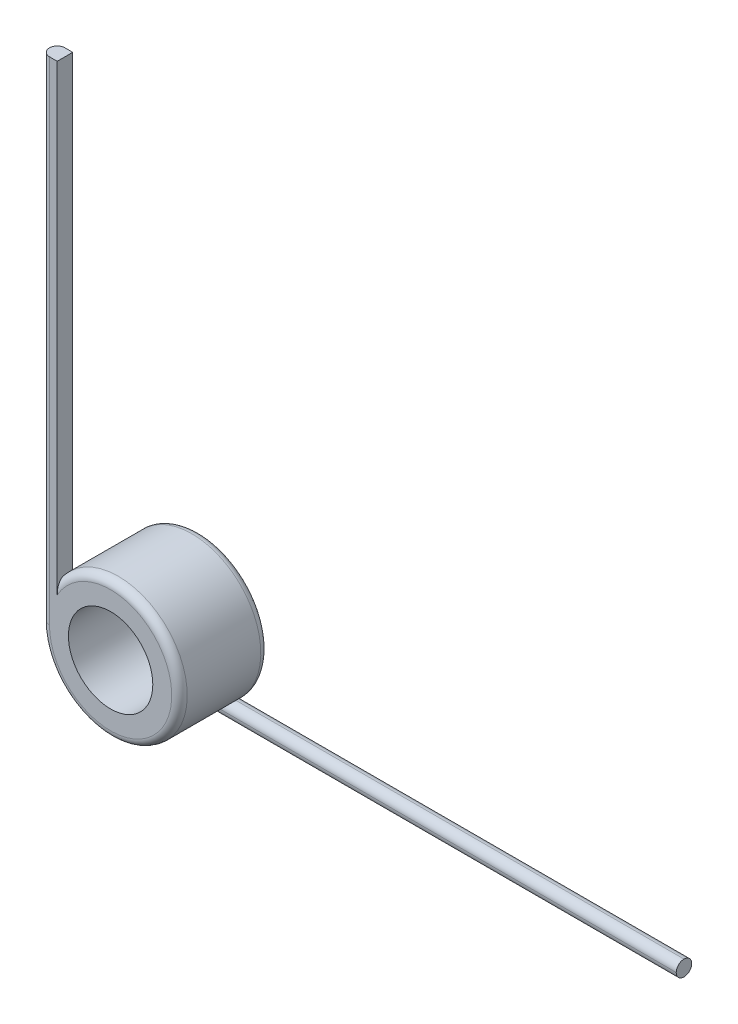
ISO-10303-21;
HEADER;
FILE_DESCRIPTION(('STEP AP214'),'2;1');
FILE_NAME('part.step','',(''),(''),'','','');
FILE_SCHEMA(('AUTOMOTIVE_DESIGN { 1 0 10303 214 1 1 1 1 }'));
ENDSEC;
DATA;
#1=APPLICATION_CONTEXT('core data for automotive mechanical design processes');
#2=APPLICATION_PROTOCOL_DEFINITION('international standard','automotive_design',2000,#1);
#3=PRODUCT_CONTEXT('',#1,'mechanical');
#4=PRODUCT('Part','Part','',(#3));
#5=PRODUCT_RELATED_PRODUCT_CATEGORY('part','',(#4));
#6=PRODUCT_DEFINITION_FORMATION('','',#4);
#7=PRODUCT_DEFINITION_CONTEXT('part definition',#1,'design');
#8=PRODUCT_DEFINITION('design','',#6,#7);
#9=PRODUCT_DEFINITION_SHAPE('','',#8);
#10=(LENGTH_UNIT() NAMED_UNIT(*) SI_UNIT(.MILLI.,.METRE.));
#11=(NAMED_UNIT(*) PLANE_ANGLE_UNIT() SI_UNIT($,.RADIAN.));
#12=(NAMED_UNIT(*) SI_UNIT($,.STERADIAN.) SOLID_ANGLE_UNIT());
#13=UNCERTAINTY_MEASURE_WITH_UNIT(LENGTH_MEASURE(1.E-05),#10,'distance_accuracy_value','');
#14=(GEOMETRIC_REPRESENTATION_CONTEXT(3) GLOBAL_UNCERTAINTY_ASSIGNED_CONTEXT((#13)) GLOBAL_UNIT_ASSIGNED_CONTEXT((#10,
#11,#12)) REPRESENTATION_CONTEXT('',''));
#15=CARTESIAN_POINT('',(0.,0.,0.));
#16=DIRECTION('',(0.,0.,1.));
#17=DIRECTION('',(1.,0.,0.));
#18=AXIS2_PLACEMENT_3D('',#15,#16,#17);
#19=CARTESIAN_POINT('',(0.,0.,9.1948));
#20=DIRECTION('',(0.,0.,-1.));
#21=DIRECTION('',(-1.,0.,0.));
#22=AXIS2_PLACEMENT_3D('',#19,#20,#21);
#23=CYLINDRICAL_SURFACE('',#22,7.112);
#24=DIRECTION('',(0.,0.,1.));
#25=VECTOR('',#24,1.);
#26=CARTESIAN_POINT('',(-5.51179999999997,4.49450828901231,7.5946));
#27=LINE('',#26,#25);
#28=CARTESIAN_POINT('',(-5.51179999999997,4.49450828901231,7.5946));
#29=VERTEX_POINT('',#28);
#30=CARTESIAN_POINT('',(-5.51179999999997,4.49450828901231,8.3947));
#31=VERTEX_POINT('',#30);
#32=EDGE_CURVE('E113',#29,#31,#27,.T.);
#33=ORIENTED_EDGE('',*,*,#32,.T.);
#34=CARTESIAN_POINT('',(0.,0.,8.3947));
#35=DIRECTION('',(0.,0.,1.));
#36=DIRECTION('',(1.,0.,0.));
#37=AXIS2_PLACEMENT_3D('',#34,#35,#36);
#38=CIRCLE('',#37,7.112);
#39=CARTESIAN_POINT('',(-7.112,0.,8.3947));
#40=VERTEX_POINT('',#39);
#41=EDGE_CURVE('E155',#31,#40,#38,.F.);
#42=ORIENTED_EDGE('',*,*,#41,.T.);
#43=CARTESIAN_POINT('',(-6.31189999999998,3.27726446750949,7.5946));
#44=CARTESIAN_POINT('',(-6.33863640810556,3.22577319071098,7.59460874121384));
#45=CARTESIAN_POINT('',(-6.36473209160568,3.17397080121041,7.59593894352443));
#46=CARTESIAN_POINT('',(-6.41559687844701,3.06985554330412,7.60093516358518));
#47=CARTESIAN_POINT('',(-6.44036654805307,3.01754290426369,7.60460017550517));
#48=CARTESIAN_POINT('',(-6.5125478029737,2.86016865994781,7.61861872182236));
#49=CARTESIAN_POINT('',(-6.55794815943721,2.75444607475935,7.6319984877271));
#50=CARTESIAN_POINT('',(-6.64307265846747,2.54227229890445,7.66493502375928));
#51=CARTESIAN_POINT('',(-6.68282029059782,2.43582617169207,7.6844650790488));
#52=CARTESIAN_POINT('',(-6.75692707930679,2.22200236123472,7.72839217607958));
#53=CARTESIAN_POINT('',(-6.79128248733931,2.11462408422718,7.75279257703432));
#54=CARTESIAN_POINT('',(-6.87124565452522,1.84276867346078,7.81917071884919));
#55=CARTESIAN_POINT('',(-6.91331709761538,1.67785384252942,7.86365942235867));
#56=CARTESIAN_POINT('',(-6.98530174523663,1.34713711270924,7.95853999945249));
#57=CARTESIAN_POINT('',(-7.01521160149209,1.18133498224522,8.00893349380584));
#58=CARTESIAN_POINT('',(-7.08709086236258,0.682899888290358,8.16566943485298));
#59=CARTESIAN_POINT('',(-7.11123322508794,0.349157968962982,8.27758917674899));
#60=CARTESIAN_POINT('',(-7.11199400277877,0.0106605278621833,8.39112437230443));
#61=CARTESIAN_POINT('',(-7.1119999947834,0.00533018613457503,8.39291222380705));
#62=CARTESIAN_POINT('',(-7.112,0.,8.3947));
#63=B_SPLINE_CURVE_WITH_KNOTS('',3,(#43,#44,#45,#46,#47,#48,#49,#50,#51,#52,#53,#54,#55,#56,#57,
#58,#59,#60,#61,#62),.UNSPECIFIED.,.F.,.F.,(4,2,2,2,2,2,2,2,2,4),(0.,0.174006957486823,
0.347939003854618,0.695046557647384,1.04066671662638,1.38652608839392,1.91360707300454,
2.44083307318049,3.49502816093425,3.51189470542901),.UNSPECIFIED.);
#64=CARTESIAN_POINT('',(-6.31189999999998,3.27726446750949,7.5946));
#65=VERTEX_POINT('',#64);
#66=EDGE_CURVE('E116',#40,#65,#63,.F.);
#67=ORIENTED_EDGE('',*,*,#66,.T.);
#68=CARTESIAN_POINT('',(0.,0.,7.5946));
#69=DIRECTION('',(0.,0.,-1.));
#70=DIRECTION('',(1.,0.,0.));
#71=AXIS2_PLACEMENT_3D('',#68,#69,#70);
#72=CIRCLE('',#71,7.112);
#73=EDGE_CURVE('E111',#65,#29,#72,.T.);
#74=ORIENTED_EDGE('',*,*,#73,.T.);
#75=EDGE_LOOP('',(#33,#42,#67,#74));
#76=FACE_BOUND('',#75,.T.);
#77=CARTESIAN_POINT('',(3.27726446750945,-6.3119,1.6002));
#78=CARTESIAN_POINT('',(3.22577319071094,-6.33863640810558,1.60019125878616));
#79=CARTESIAN_POINT('',(3.17397080121037,-6.3647320916057,1.59886105647557));
#80=CARTESIAN_POINT('',(3.06985554330409,-6.41559687844702,1.59386483641482));
#81=CARTESIAN_POINT('',(3.01754290426367,-6.44036654805308,1.59019982449484));
#82=CARTESIAN_POINT('',(2.8601686599478,-6.51254780297371,1.57618127817764));
#83=CARTESIAN_POINT('',(2.75444607475934,-6.55794815943721,1.56280151227291));
#84=CARTESIAN_POINT('',(2.54227229890444,-6.64307265846747,1.52986497624073));
#85=CARTESIAN_POINT('',(2.43582617169205,-6.68282029059783,1.5103349209512));
#86=CARTESIAN_POINT('',(2.22200236123469,-6.7569270793068,1.46640782392042));
#87=CARTESIAN_POINT('',(2.11462408422714,-6.79128248733932,1.44200742296568));
#88=CARTESIAN_POINT('',(1.84276867346074,-6.87124565452523,1.37562928115081));
#89=CARTESIAN_POINT('',(1.67785384252937,-6.9133170976154,1.33114057764134));
#90=CARTESIAN_POINT('',(1.34713711270919,-6.98530174523664,1.2362600005475));
#91=CARTESIAN_POINT('',(1.18133498224518,-7.0152116014921,1.1858665061941));
#92=CARTESIAN_POINT('',(0.682899888290263,-7.08709086236258,1.02913056514713));
#93=CARTESIAN_POINT('',(0.349157968962726,-7.11123322508794,0.91721082325161));
#94=CARTESIAN_POINT('',(0.010660527862127,-7.11199400277877,0.803675627695595));
#95=CARTESIAN_POINT('',(0.00533018613452203,-7.1119999947834,0.801887776192962));
#96=CARTESIAN_POINT('',(0.,-7.112,0.8001));
#97=B_SPLINE_CURVE_WITH_KNOTS('',3,(#77,#78,#79,#80,#81,#82,#83,#84,#85,#86,#87,#88,#89,#90,#91,
#92,#93,#94,#95,#96),.UNSPECIFIED.,.F.,.F.,(4,2,2,2,2,2,2,2,2,4),(0.,0.174006957486809,
0.347939003854589,0.695046557647333,1.04066671662635,1.38652608839392,1.91360707300454,
2.4408330731805,3.49502816093425,3.51189470542901),.UNSPECIFIED.);
#98=CARTESIAN_POINT('',(0.,-7.112,0.8001));
#99=VERTEX_POINT('',#98);
#100=CARTESIAN_POINT('',(3.27726446750945,-6.3119,1.6002));
#101=VERTEX_POINT('',#100);
#102=EDGE_CURVE('E44',#99,#101,#97,.F.);
#103=ORIENTED_EDGE('',*,*,#102,.T.);
#104=CARTESIAN_POINT('',(3.27726446750944,-6.3119,1.6002));
#105=CARTESIAN_POINT('',(3.33684636501457,-6.28097233450951,1.60017049334555));
#106=CARTESIAN_POINT('',(3.39603078899823,-6.24916342132022,1.59840213107609));
#107=CARTESIAN_POINT('',(3.51355143645542,-6.1838510683771,1.59058391450078));
#108=CARTESIAN_POINT('',(3.57188188450809,-6.15033989895407,1.58451253492));
#109=CARTESIAN_POINT('',(3.68766233258711,-6.08163436560927,1.56717472422965));
#110=CARTESIAN_POINT('',(3.74509577354935,-6.04642562220361,1.55585231329157));
#111=CARTESIAN_POINT('',(3.85771272353521,-5.97519985193681,1.52692175758249));
#112=CARTESIAN_POINT('',(3.91290116558248,-5.93918490073875,1.50932832797823));
#113=CARTESIAN_POINT('',(4.00525249208175,-5.87713169880061,1.4724463789553));
#114=CARTESIAN_POINT('',(4.04315445374767,-5.8511087348269,1.45499498077383));
#115=CARTESIAN_POINT('',(4.11678717653781,-5.79953625179383,1.41548426425632));
#116=CARTESIAN_POINT('',(4.15252050554959,-5.77398619871112,1.39343053861775));
#117=CARTESIAN_POINT('',(4.22138970936993,-5.72383115259485,1.34378451989652));
#118=CARTESIAN_POINT('',(4.25449880463333,-5.69923695516696,1.31614336190655));
#119=CARTESIAN_POINT('',(4.31651957433504,-5.65240697734943,1.25475689981927));
#120=CARTESIAN_POINT('',(4.34543791946912,-5.63016746439981,1.22102149303283));
#121=CARTESIAN_POINT('',(4.38939727605734,-5.59591490763217,1.15840313928524));
#122=CARTESIAN_POINT('',(4.40597974002243,-5.58285251332364,1.13118262316452));
#123=CARTESIAN_POINT('',(4.43551677737668,-5.55941455104074,1.07374889291683));
#124=CARTESIAN_POINT('',(4.44847432845384,-5.54903677831235,1.04353816288834));
#125=CARTESIAN_POINT('',(4.46851837696362,-5.53290439682252,0.984832314482142));
#126=CARTESIAN_POINT('',(4.47615757469814,-5.52671766818688,0.956646183382705));
#127=CARTESIAN_POINT('',(4.48762439734802,-5.51741148642021,0.899053502659542));
#128=CARTESIAN_POINT('',(4.49146083255315,-5.51428494362298,0.869649939178288));
#129=CARTESIAN_POINT('',(4.4941023454781,-5.51213071648264,0.826766808368351));
#130=CARTESIAN_POINT('',(4.49451449298493,-5.51179415880985,0.81343061952327));
#131=CARTESIAN_POINT('',(4.49450828901227,-5.51180000000001,0.8001));
#132=B_SPLINE_CURVE_WITH_KNOTS('',3,(#104,#105,#106,#107,#108,#109,#110,#111,#112,#113,#114,
#115,#116,#117,#118,#119,#120,#121,#122,#123,#124,#125,#126,#127,#128,#129,#130,#131),
.UNSPECIFIED.,.F.,.F.,(4,2,2,2,2,2,2,2,2,2,2,2,2,4),(0.,0.201444525566419,0.403903928729936,
0.608573143021147,0.81276522170529,0.96008176445519,1.10722032145835,1.25570615356907,
1.40395297175356,1.50694498887674,1.60985215301296,1.69902772272233,1.78799620300548,
1.82799412834761),.UNSPECIFIED.);
#133=CARTESIAN_POINT('',(4.49450828901226,-5.51180000000001,0.8001));
#134=VERTEX_POINT('',#133);
#135=EDGE_CURVE('E11',#101,#134,#132,.T.);
#136=ORIENTED_EDGE('',*,*,#135,.T.);
#137=CARTESIAN_POINT('',(0.,0.,0.8001));
#138=DIRECTION('',(0.,0.,1.));
#139=DIRECTION('',(1.,0.,0.));
#140=AXIS2_PLACEMENT_3D('',#137,#138,#139);
#141=CIRCLE('',#140,7.112);
#142=EDGE_CURVE('E260',#134,#99,#141,.T.);
#143=ORIENTED_EDGE('',*,*,#142,.T.);
#144=EDGE_LOOP('',(#103,#136,#143));
#145=FACE_BOUND('',#144,.T.);
#146=ADVANCED_FACE('F34',(#76,#145),#23,.T.);
#147=CARTESIAN_POINT('',(0.,0.,9.1948));
#148=DIRECTION('',(0.,0.,1.));
#149=DIRECTION('',(1.,0.,0.));
#150=AXIS2_PLACEMENT_3D('',#147,#148,#149);
#151=PLANE('',#150);
#152=CARTESIAN_POINT('',(0.,0.,9.1948));
#153=DIRECTION('',(0.,0.,1.));
#154=DIRECTION('',(1.,0.,0.));
#155=AXIS2_PLACEMENT_3D('',#152,#153,#154);
#156=CIRCLE('',#155,6.3119);
#157=CARTESIAN_POINT('',(-6.3119,0.,9.1948));
#158=VERTEX_POINT('',#157);
#159=CARTESIAN_POINT('',(-5.51179999999998,3.07573444399875,9.1948));
#160=VERTEX_POINT('',#159);
#161=EDGE_CURVE('E152',#158,#160,#156,.T.);
#162=ORIENTED_EDGE('',*,*,#161,.T.);
#163=DIRECTION('',(0.,1.,0.));
#164=VECTOR('',#163,1.);
#165=CARTESIAN_POINT('',(-5.51179999999965,50.8,9.1948));
#166=LINE('',#165,#164);
#167=CARTESIAN_POINT('',(-5.51179999999965,50.8,9.1948));
#168=VERTEX_POINT('',#167);
#169=EDGE_CURVE('E137',#160,#168,#166,.T.);
#170=ORIENTED_EDGE('',*,*,#169,.T.);
#171=DIRECTION('',(-1.,0.,0.));
#172=VECTOR('',#171,1.);
#173=CARTESIAN_POINT('',(-7.11199999999965,50.8,9.1948));
#174=LINE('',#173,#172);
#175=CARTESIAN_POINT('',(-6.31189999999965,50.8,9.1948));
#176=VERTEX_POINT('',#175);
#177=EDGE_CURVE('E121',#168,#176,#174,.T.);
#178=ORIENTED_EDGE('',*,*,#177,.T.);
#179=DIRECTION('',(0.,-1.,0.));
#180=VECTOR('',#179,1.);
#181=CARTESIAN_POINT('',(-6.3119,0.,9.1948));
#182=LINE('',#181,#180);
#183=EDGE_CURVE('E148',#176,#158,#182,.T.);
#184=ORIENTED_EDGE('',*,*,#183,.T.);
#185=EDGE_LOOP('',(#162,#170,#178,#184));
#186=FACE_BOUND('',#185,.T.);
#187=CARTESIAN_POINT('',(0.,0.,9.1948));
#188=DIRECTION('',(0.,0.,1.));
#189=DIRECTION('',(1.,0.,0.));
#190=AXIS2_PLACEMENT_3D('',#187,#188,#189);
#191=CIRCLE('',#190,4.3561);
#192=CARTESIAN_POINT('',(4.3561,0.,9.1948));
#193=VERTEX_POINT('',#192);
#194=EDGE_CURVE('E145',#193,#193,#191,.T.);
#195=ORIENTED_EDGE('',*,*,#194,.F.);
#196=EDGE_LOOP('',(#195));
#197=FACE_BOUND('',#196,.T.);
#198=ADVANCED_FACE('F191',(#186,#197),#151,.T.);
#199=CARTESIAN_POINT('',(0.,0.,0.));
#200=DIRECTION('',(0.,0.,1.));
#201=DIRECTION('',(1.,0.,0.));
#202=AXIS2_PLACEMENT_3D('',#199,#200,#201);
#203=PLANE('',#202);
#204=CARTESIAN_POINT('',(0.,0.,0.));
#205=DIRECTION('',(0.,0.,1.));
#206=DIRECTION('',(1.,0.,0.));
#207=AXIS2_PLACEMENT_3D('',#204,#205,#206);
#208=CIRCLE('',#207,6.3119);
#209=CARTESIAN_POINT('',(0.,-6.3119,0.));
#210=VERTEX_POINT('',#209);
#211=EDGE_CURVE('E255',#210,#210,#208,.F.);
#212=ORIENTED_EDGE('',*,*,#211,.T.);
#213=EDGE_LOOP('',(#212));
#214=FACE_BOUND('',#213,.T.);
#215=CARTESIAN_POINT('',(0.,0.,0.));
#216=DIRECTION('',(0.,0.,1.));
#217=DIRECTION('',(1.,0.,0.));
#218=AXIS2_PLACEMENT_3D('',#215,#216,#217);
#219=CIRCLE('',#218,4.3561);
#220=CARTESIAN_POINT('',(4.3561,0.,0.));
#221=VERTEX_POINT('',#220);
#222=EDGE_CURVE('E143',#221,#221,#219,.T.);
#223=ORIENTED_EDGE('',*,*,#222,.T.);
#224=EDGE_LOOP('',(#223));
#225=FACE_BOUND('',#224,.T.);
#226=ADVANCED_FACE('F189',(#214,#225),#203,.F.);
#227=CARTESIAN_POINT('',(0.,0.,9.1948));
#228=DIRECTION('',(0.,0.,-1.));
#229=DIRECTION('',(-1.,0.,0.));
#230=AXIS2_PLACEMENT_3D('',#227,#228,#229);
#231=CYLINDRICAL_SURFACE('',#230,4.3561);
#232=ORIENTED_EDGE('',*,*,#194,.T.);
#233=EDGE_LOOP('',(#232));
#234=FACE_BOUND('',#233,.T.);
#235=ORIENTED_EDGE('',*,*,#222,.F.);
#236=EDGE_LOOP('',(#235));
#237=FACE_BOUND('',#236,.T.);
#238=ADVANCED_FACE('F186',(#234,#237),#231,.F.);
#239=CARTESIAN_POINT('',(-7.11199999999965,50.8,7.5946));
#240=DIRECTION('',(0.,1.,0.));
#241=DIRECTION('',(-1.,0.,0.));
#242=AXIS2_PLACEMENT_3D('',#239,#240,#241);
#243=PLANE('',#242);
#244=DIRECTION('',(-1.,0.,0.));
#245=VECTOR('',#244,1.);
#246=CARTESIAN_POINT('',(-7.11199999999965,50.8,7.5946));
#247=LINE('',#246,#245);
#248=CARTESIAN_POINT('',(-5.51179999999965,50.8,7.5946));
#249=VERTEX_POINT('',#248);
#250=CARTESIAN_POINT('',(-6.31189999999965,50.8,7.5946));
#251=VERTEX_POINT('',#250);
#252=EDGE_CURVE('E129',#249,#251,#247,.T.);
#253=ORIENTED_EDGE('',*,*,#252,.T.);
#254=CARTESIAN_POINT('',(-6.31189999999965,50.8,8.3947));
#255=DIRECTION('',(0.,1.,0.));
#256=DIRECTION('',(-1.,0.,0.));
#257=AXIS2_PLACEMENT_3D('',#254,#255,#256);
#258=CIRCLE('',#257,0.8001);
#259=CARTESIAN_POINT('',(-7.11199999999965,50.8,8.3947));
#260=VERTEX_POINT('',#259);
#261=EDGE_CURVE('E161',#251,#260,#258,.T.);
#262=ORIENTED_EDGE('',*,*,#261,.T.);
#263=CARTESIAN_POINT('',(-6.31189999999965,50.8,8.3947));
#264=DIRECTION('',(0.,1.,0.));
#265=DIRECTION('',(-1.,0.,0.));
#266=AXIS2_PLACEMENT_3D('',#263,#264,#265);
#267=CIRCLE('',#266,0.8001);
#268=EDGE_CURVE('E159',#260,#176,#267,.T.);
#269=ORIENTED_EDGE('',*,*,#268,.T.);
#270=ORIENTED_EDGE('',*,*,#177,.F.);
#271=DIRECTION('',(0.,0.,1.));
#272=VECTOR('',#271,1.);
#273=CARTESIAN_POINT('',(-5.51179999999965,50.8,7.5946));
#274=LINE('',#273,#272);
#275=EDGE_CURVE('E128',#249,#168,#274,.T.);
#276=ORIENTED_EDGE('',*,*,#275,.F.);
#277=EDGE_LOOP('',(#253,#262,#269,#270,#276));
#278=FACE_BOUND('',#277,.T.);
#279=ADVANCED_FACE('F184',(#278),#243,.T.);
#280=CARTESIAN_POINT('',(-5.51179999999965,50.8,7.5946));
#281=DIRECTION('',(1.,0.,0.));
#282=DIRECTION('',(0.,1.,0.));
#283=AXIS2_PLACEMENT_3D('',#280,#281,#282);
#284=PLANE('',#283);
#285=ORIENTED_EDGE('',*,*,#169,.F.);
#286=CARTESIAN_POINT('',(-5.51179999999998,3.07573444399875,9.1948));
#287=CARTESIAN_POINT('',(-5.51179999999997,3.14284737824185,9.19477237796938));
#288=CARTESIAN_POINT('',(-5.51179999999997,3.21002072062758,9.1927908275445));
#289=CARTESIAN_POINT('',(-5.51179999999997,3.34443100206359,9.18411012358241));
#290=CARTESIAN_POINT('',(-5.51179999999997,3.41166618327304,9.17738456303612));
#291=CARTESIAN_POINT('',(-5.51179999999997,3.54616467127513,9.15827708359304));
#292=CARTESIAN_POINT('',(-5.51179999999997,3.61341904759422,9.14582970799186));
#293=CARTESIAN_POINT('',(-5.51179999999997,3.74620940317035,9.11420171357396));
#294=CARTESIAN_POINT('',(-5.51179999999997,3.81174934403642,9.09503842961656));
#295=CARTESIAN_POINT('',(-5.51179999999997,3.92098116703676,9.05548764085404));
#296=CARTESIAN_POINT('',(-5.51179999999997,3.96540586241315,9.03713547690971));
#297=CARTESIAN_POINT('',(-5.51179999999997,4.05205151216685,8.99586472575388));
#298=CARTESIAN_POINT('',(-5.51179999999997,4.09427526686859,8.97295212919733));
#299=CARTESIAN_POINT('',(-5.51179999999997,4.17588633368204,8.92169957527681));
#300=CARTESIAN_POINT('',(-5.51179999999997,4.21524406495145,8.89331174781876));
#301=CARTESIAN_POINT('',(-5.51179999999997,4.28903391559424,8.83065365272651));
#302=CARTESIAN_POINT('',(-5.51179999999997,4.32347241616555,8.79639113509689));
#303=CARTESIAN_POINT('',(-5.51179999999997,4.37573644943357,8.73305845305065));
#304=CARTESIAN_POINT('',(-5.51179999999997,4.39543842094804,8.70554414521773));
#305=CARTESIAN_POINT('',(-5.51179999999997,4.4302230063563,8.6478007221031));
#306=CARTESIAN_POINT('',(-5.51179999999997,4.44531901815191,8.61757981805753));
#307=CARTESIAN_POINT('',(-5.51179999999997,4.46947963654015,8.55593860751243));
#308=CARTESIAN_POINT('',(-5.51179999999997,4.47873081507428,8.52459333839258));
#309=CARTESIAN_POINT('',(-5.51179999999997,4.48812591418598,8.47656220740092));
#310=CARTESIAN_POINT('',(-5.51179999999997,4.49051117776858,8.46029330112052));
#311=CARTESIAN_POINT('',(-5.51179999999997,4.49370495550089,8.42758655132458));
#312=CARTESIAN_POINT('',(-5.51179999999997,4.494511995831,8.41114856429676));
#313=CARTESIAN_POINT('',(-5.51179999999997,4.49450828901231,8.3947));
#314=B_SPLINE_CURVE_WITH_KNOTS('',3,(#286,#287,#288,#289,#290,#291,#292,#293,#294,#295,#296,
#297,#298,#299,#300,#301,#302,#303,#304,#305,#306,#307,#308,#309,#310,#311,#312,#313),
.UNSPECIFIED.,.F.,.F.,(4,2,2,2,2,2,2,2,2,2,2,2,2,4),(0.,0.201403139676493,0.403936306206965,
0.608846402683101,0.813231441484448,0.957216778876482,1.10101420858841,1.24613106172415,
1.39105792648684,1.49222558674595,1.59309609968159,1.69055806022176,1.73981812803838,
1.78912417531273),.UNSPECIFIED.);
#315=EDGE_CURVE('E127',#160,#31,#314,.T.);
#316=ORIENTED_EDGE('',*,*,#315,.T.);
#317=ORIENTED_EDGE('',*,*,#32,.F.);
#318=DIRECTION('',(0.,1.,0.));
#319=VECTOR('',#318,1.);
#320=CARTESIAN_POINT('',(-5.51179999999965,50.8,7.5946));
#321=LINE('',#320,#319);
#322=EDGE_CURVE('E120',#29,#249,#321,.T.);
#323=ORIENTED_EDGE('',*,*,#322,.T.);
#324=ORIENTED_EDGE('',*,*,#275,.T.);
#325=EDGE_LOOP('',(#285,#316,#317,#323,#324));
#326=FACE_BOUND('',#325,.T.);
#327=ADVANCED_FACE('F125',(#326),#284,.T.);
#328=CARTESIAN_POINT('',(0.,0.,7.5946));
#329=DIRECTION('',(0.,0.,1.));
#330=DIRECTION('',(1.,0.,0.));
#331=AXIS2_PLACEMENT_3D('',#328,#329,#330);
#332=PLANE('',#331);
#333=ORIENTED_EDGE('',*,*,#73,.F.);
#334=DIRECTION('',(0.,-1.,0.));
#335=VECTOR('',#334,1.);
#336=CARTESIAN_POINT('',(-6.31189999999965,50.8,7.5946));
#337=LINE('',#336,#335);
#338=EDGE_CURVE('E157',#65,#251,#337,.F.);
#339=ORIENTED_EDGE('',*,*,#338,.T.);
#340=ORIENTED_EDGE('',*,*,#252,.F.);
#341=ORIENTED_EDGE('',*,*,#322,.F.);
#342=EDGE_LOOP('',(#333,#339,#340,#341));
#343=FACE_BOUND('',#342,.T.);
#344=ADVANCED_FACE('F132',(#343),#332,.F.);
#345=CARTESIAN_POINT('',(-6.3119,0.,8.3947));
#346=DIRECTION('',(0.,1.,0.));
#347=DIRECTION('',(-1.,0.,0.));
#348=AXIS2_PLACEMENT_3D('',#345,#346,#347);
#349=CYLINDRICAL_SURFACE('',#348,0.8001);
#350=DIRECTION('',(0.,-1.,0.));
#351=VECTOR('',#350,1.);
#352=CARTESIAN_POINT('',(-7.112,0.,8.3947));
#353=LINE('',#352,#351);
#354=EDGE_CURVE('E140',#260,#40,#353,.T.);
#355=ORIENTED_EDGE('',*,*,#354,.F.);
#356=ORIENTED_EDGE('',*,*,#261,.F.);
#357=ORIENTED_EDGE('',*,*,#338,.F.);
#358=ORIENTED_EDGE('',*,*,#66,.F.);
#359=EDGE_LOOP('',(#355,#356,#357,#358));
#360=FACE_BOUND('',#359,.T.);
#361=ADVANCED_FACE('F286',(#360),#349,.T.);
#362=CARTESIAN_POINT('',(-6.3119,0.,8.3947));
#363=DIRECTION('',(0.,-1.,0.));
#364=DIRECTION('',(1.,0.,0.));
#365=AXIS2_PLACEMENT_3D('',#362,#363,#364);
#366=CYLINDRICAL_SURFACE('',#365,0.8001);
#367=ORIENTED_EDGE('',*,*,#268,.F.);
#368=ORIENTED_EDGE('',*,*,#354,.T.);
#369=CARTESIAN_POINT('',(-6.3119,0.,8.3947));
#370=DIRECTION('',(0.,-1.,0.));
#371=DIRECTION('',(1.,0.,0.));
#372=AXIS2_PLACEMENT_3D('',#369,#370,#371);
#373=CIRCLE('',#372,0.8001);
#374=EDGE_CURVE('E250',#158,#40,#373,.T.);
#375=ORIENTED_EDGE('',*,*,#374,.F.);
#376=ORIENTED_EDGE('',*,*,#183,.F.);
#377=EDGE_LOOP('',(#367,#368,#375,#376));
#378=FACE_BOUND('',#377,.T.);
#379=ADVANCED_FACE('F283',(#378),#366,.T.);
#380=CARTESIAN_POINT('',(0.,0.,8.3947));
#381=DIRECTION('',(0.,0.,1.));
#382=DIRECTION('',(1.,0.,0.));
#383=AXIS2_PLACEMENT_3D('',#380,#381,#382);
#384=TOROIDAL_SURFACE('',#383,6.3119,0.8001);
#385=ORIENTED_EDGE('',*,*,#374,.T.);
#386=ORIENTED_EDGE('',*,*,#41,.F.);
#387=ORIENTED_EDGE('',*,*,#315,.F.);
#388=ORIENTED_EDGE('',*,*,#161,.F.);
#389=EDGE_LOOP('',(#385,#386,#387,#388));
#390=FACE_BOUND('',#389,.T.);
#391=ADVANCED_FACE('F177',(#390),#384,.T.);
#392=CARTESIAN_POINT('',(50.8,-7.11200000000001,1.6002));
#393=DIRECTION('',(1.,0.,0.));
#394=DIRECTION('',(0.,0.,-1.));
#395=AXIS2_PLACEMENT_3D('',#392,#393,#394);
#396=PLANE('',#395);
#397=CARTESIAN_POINT('',(50.8,-6.31190000000001,0.8001));
#398=DIRECTION('',(1.,0.,0.));
#399=DIRECTION('',(0.,0.,-1.));
#400=AXIS2_PLACEMENT_3D('',#397,#398,#399);
#401=CIRCLE('',#400,0.8001);
#402=CARTESIAN_POINT('',(50.8,-5.51180000000001,0.8001));
#403=VERTEX_POINT('',#402);
#404=CARTESIAN_POINT('',(50.8,-6.31190000000001,1.6002));
#405=VERTEX_POINT('',#404);
#406=EDGE_CURVE('E252',#403,#405,#401,.T.);
#407=ORIENTED_EDGE('',*,*,#406,.T.);
#408=CARTESIAN_POINT('',(50.8,-6.31190000000001,0.8001));
#409=DIRECTION('',(1.,0.,0.));
#410=DIRECTION('',(0.,0.,-1.));
#411=AXIS2_PLACEMENT_3D('',#408,#409,#410);
#412=CIRCLE('',#411,0.8001);
#413=CARTESIAN_POINT('',(50.8,-7.11200000000001,0.8001));
#414=VERTEX_POINT('',#413);
#415=EDGE_CURVE('E207',#405,#414,#412,.T.);
#416=ORIENTED_EDGE('',*,*,#415,.T.);
#417=CARTESIAN_POINT('',(50.8,-6.31190000000001,0.8001));
#418=DIRECTION('',(1.,0.,0.));
#419=DIRECTION('',(0.,0.,-1.));
#420=AXIS2_PLACEMENT_3D('',#417,#418,#419);
#421=CIRCLE('',#420,0.8001);
#422=CARTESIAN_POINT('',(50.8,-6.31190000000001,0.));
#423=VERTEX_POINT('',#422);
#424=EDGE_CURVE('E58',#414,#423,#421,.T.);
#425=ORIENTED_EDGE('',*,*,#424,.T.);
#426=CARTESIAN_POINT('',(50.8,-6.31190000000001,0.8001));
#427=DIRECTION('',(1.,0.,0.));
#428=DIRECTION('',(0.,0.,-1.));
#429=AXIS2_PLACEMENT_3D('',#426,#427,#428);
#430=CIRCLE('',#429,0.8001);
#431=EDGE_CURVE('E253',#423,#403,#430,.T.);
#432=ORIENTED_EDGE('',*,*,#431,.T.);
#433=EDGE_LOOP('',(#407,#416,#425,#432));
#434=FACE_BOUND('',#433,.T.);
#435=ADVANCED_FACE('F268',(#434),#396,.T.);
#436=CARTESIAN_POINT('',(50.8,-6.31190000000001,0.8001));
#437=DIRECTION('',(-1.,0.,0.));
#438=DIRECTION('',(0.,-1.,0.));
#439=AXIS2_PLACEMENT_3D('',#436,#437,#438);
#440=CYLINDRICAL_SURFACE('',#439,0.8001);
#441=DIRECTION('',(1.,0.,0.));
#442=VECTOR('',#441,1.);
#443=CARTESIAN_POINT('',(50.8,-5.51180000000001,0.8001));
#444=LINE('',#443,#442);
#445=EDGE_CURVE('E244',#134,#403,#444,.T.);
#446=ORIENTED_EDGE('',*,*,#445,.F.);
#447=ORIENTED_EDGE('',*,*,#135,.F.);
#448=DIRECTION('',(1.,0.,0.));
#449=VECTOR('',#448,1.);
#450=CARTESIAN_POINT('',(4.49450828901227,-6.3119,1.6002));
#451=LINE('',#450,#449);
#452=EDGE_CURVE('E247',#405,#101,#451,.F.);
#453=ORIENTED_EDGE('',*,*,#452,.F.);
#454=ORIENTED_EDGE('',*,*,#406,.F.);
#455=EDGE_LOOP('',(#446,#447,#453,#454));
#456=FACE_BOUND('',#455,.T.);
#457=ADVANCED_FACE('F36',(#456),#440,.T.);
#458=CARTESIAN_POINT('',(0.,-6.3119,0.8001));
#459=DIRECTION('',(1.,0.,0.));
#460=DIRECTION('',(0.,1.,0.));
#461=AXIS2_PLACEMENT_3D('',#458,#459,#460);
#462=CYLINDRICAL_SURFACE('',#461,0.8001);
#463=ORIENTED_EDGE('',*,*,#452,.T.);
#464=ORIENTED_EDGE('',*,*,#102,.F.);
#465=DIRECTION('',(-1.,0.,0.));
#466=VECTOR('',#465,1.);
#467=CARTESIAN_POINT('',(0.,-7.112,0.8001));
#468=LINE('',#467,#466);
#469=EDGE_CURVE('E240',#414,#99,#468,.T.);
#470=ORIENTED_EDGE('',*,*,#469,.F.);
#471=ORIENTED_EDGE('',*,*,#415,.F.);
#472=EDGE_LOOP('',(#463,#464,#470,#471));
#473=FACE_BOUND('',#472,.T.);
#474=ADVANCED_FACE('F214',(#473),#462,.T.);
#475=CARTESIAN_POINT('',(0.,-6.3119,0.8001));
#476=DIRECTION('',(-1.,0.,0.));
#477=DIRECTION('',(0.,-1.,0.));
#478=AXIS2_PLACEMENT_3D('',#475,#476,#477);
#479=CYLINDRICAL_SURFACE('',#478,0.8001);
#480=ORIENTED_EDGE('',*,*,#445,.T.);
#481=ORIENTED_EDGE('',*,*,#431,.F.);
#482=DIRECTION('',(1.,0.,0.));
#483=VECTOR('',#482,1.);
#484=CARTESIAN_POINT('',(50.8,-6.31190000000001,0.));
#485=LINE('',#484,#483);
#486=EDGE_CURVE('E237',#210,#423,#485,.T.);
#487=ORIENTED_EDGE('',*,*,#486,.F.);
#488=CARTESIAN_POINT('',(0.,-6.3119,0.));
#489=CARTESIAN_POINT('',(0.0374523527848874,-6.31190002432631,3.01436874141789E-07));
#490=CARTESIAN_POINT('',(0.0749047367558601,-6.31173333300694,5.09058655689362E-08));
#491=CARTESIAN_POINT('',(0.164855495814471,-6.31093272425839,3.03877549536374E-07));
#492=CARTESIAN_POINT('',(0.217352485455451,-6.31013797703391,1.15082484326111E-06));
#493=CARTESIAN_POINT('',(0.329629665352214,-6.30773797000944,9.80760967250405E-06));
#494=CARTESIAN_POINT('',(0.38940781534155,-6.30603539533736,1.85690270420397E-05));
#495=CARTESIAN_POINT('',(0.493238127095373,-6.30234100607706,5.5639882035134E-05));
#496=CARTESIAN_POINT('',(0.537297365272404,-6.30054257908132,7.82113075640906E-05));
#497=CARTESIAN_POINT('',(0.669440668067975,-6.29445710444904,0.000179526392677722));
#498=CARTESIAN_POINT('',(0.757494255802549,-6.28947976427582,0.000291869876275909));
#499=CARTESIAN_POINT('',(0.933529410902045,-6.27768988851447,0.000710505163613114));
#500=CARTESIAN_POINT('',(1.02151090163266,-6.27087623594999,0.00101691516612758));
#501=CARTESIAN_POINT('',(1.28634724560673,-6.24760098132643,0.00243167822126003));
#502=CARTESIAN_POINT('',(1.46296534408856,-6.22835710954279,0.00403793380772624));
#503=CARTESIAN_POINT('',(1.81528380706266,-6.18261241359549,0.0101787034896278));
#504=CARTESIAN_POINT('',(1.99098373465153,-6.1561084074724,0.014714502726835));
#505=CARTESIAN_POINT('',(2.34066827149551,-6.09610758260881,0.0290262713149741));
#506=CARTESIAN_POINT('',(2.51465553596065,-6.06262435263576,0.0387921147518492));
#507=CARTESIAN_POINT('',(2.77397869008803,-6.00741632921059,0.0599440691760812));
#508=CARTESIAN_POINT('',(2.86011567790168,-5.98819019432646,0.0680748812659426));
#509=CARTESIAN_POINT('',(3.03170425203683,-5.94814759003884,0.0871214018182289));
#510=CARTESIAN_POINT('',(3.11715594575212,-5.92733137542248,0.0980366647659666));
#511=CARTESIAN_POINT('',(3.2788951215567,-5.88630447540547,0.122206832318267));
#512=CARTESIAN_POINT('',(3.35526592635174,-5.86623164921871,0.135131135361543));
#513=CARTESIAN_POINT('',(3.50709193583606,-5.82496573878203,0.164725675657255));
#514=CARTESIAN_POINT('',(3.5825458006109,-5.80377121243471,0.181400829221394));
#515=CARTESIAN_POINT('',(3.73673141819384,-5.75910024616562,0.22085285219773));
#516=CARTESIAN_POINT('',(3.81536858938652,-5.7355642684319,0.243948977074694));
#517=CARTESIAN_POINT('',(3.93107494157096,-5.6998870054076,0.284428411007107));
#518=CARTESIAN_POINT('',(3.96923079690786,-5.68794482131624,0.298876278273718));
#519=CARTESIAN_POINT('',(4.04453103612241,-5.66404362626819,0.330172129152249));
#520=CARTESIAN_POINT('',(4.08167600850312,-5.65208462955727,0.347018679115464));
#521=CARTESIAN_POINT('',(4.14683724268468,-5.63082807477024,0.379864136267797));
#522=CARTESIAN_POINT('',(4.17512835313505,-5.62150049693129,0.395294190038293));
#523=CARTESIAN_POINT('',(4.23047187328521,-5.60307511821248,0.428496660070931));
#524=CARTESIAN_POINT('',(4.25752226260401,-5.59397770222273,0.446272725978179));
#525=CARTESIAN_POINT('',(4.30992482216882,-5.57619602234532,0.484890086905374));
#526=CARTESIAN_POINT('',(4.33525957696279,-5.56751619798316,0.50575745420821));
#527=CARTESIAN_POINT('',(4.38275816520399,-5.55111433406567,0.551206948299759));
#528=CARTESIAN_POINT('',(4.40493050471434,-5.54338973296054,0.575778729953819));
#529=CARTESIAN_POINT('',(4.43505870753946,-5.5328307508578,0.617238835012019));
#530=CARTESIAN_POINT('',(4.44490910840419,-5.52936466438058,0.632576449385585));
#531=CARTESIAN_POINT('',(4.46239213815225,-5.52319657458021,0.664557889180872));
#532=CARTESIAN_POINT('',(4.47003374572142,-5.5204914790846,0.681196066852729));
#533=CARTESIAN_POINT('',(4.48206170029273,-5.51622671767512,0.714521153917451));
#534=CARTESIAN_POINT('',(4.48662966936546,-5.5146032151478,0.731132309424605));
#535=CARTESIAN_POINT('',(4.49289776762535,-5.51237346025701,0.765165930944026));
#536=CARTESIAN_POINT('',(4.49455995805631,-5.51178066566991,0.782596122053405));
#537=CARTESIAN_POINT('',(4.49450828901226,-5.51180000000001,0.8001));
#538=B_SPLINE_CURVE_WITH_KNOTS('',3,(#488,#489,#490,#491,#492,#493,#494,#495,#496,#497,#498,
#499,#500,#501,#502,#503,#504,#505,#506,#507,#508,#509,#510,#511,#512,#513,#514,#515,#516,#517,
#518,#519,#520,#521,#522,#523,#524,#525,#526,#527,#528,#529,#530,#531,#532,#533,#534,#535,#536,
#537),.UNSPECIFIED.,.F.,.F.,(4,2,2,2,2,2,2,2,2,2,2,2,2,2,2,2,2,2,2,2,2,2,2,2,4),(0.,
0.112356797747285,0.269861770095045,0.449262320702384,0.581548382959657,0.846108701410476,
1.11083030897362,1.64366037407272,2.17672434171165,2.70875995311761,2.97460471903263,
3.24040697619137,3.48036951662317,3.72064843251125,3.97612691169962,4.10360463288043,
4.23100648031776,4.33157377287234,4.43229940193161,4.53392881334869,4.63527949397854,
4.69079513090693,4.7460818181353,4.79771806507766,4.85002359226931),.UNSPECIFIED.);
#539=EDGE_CURVE('E230',#134,#210,#538,.F.);
#540=ORIENTED_EDGE('',*,*,#539,.F.);
#541=EDGE_LOOP('',(#480,#481,#487,#540));
#542=FACE_BOUND('',#541,.T.);
#543=ADVANCED_FACE('F218',(#542),#479,.T.);
#544=CARTESIAN_POINT('',(0.,-6.3119,0.8001));
#545=DIRECTION('',(1.,0.,0.));
#546=DIRECTION('',(0.,1.,0.));
#547=AXIS2_PLACEMENT_3D('',#544,#545,#546);
#548=CYLINDRICAL_SURFACE('',#547,0.8001);
#549=ORIENTED_EDGE('',*,*,#424,.F.);
#550=ORIENTED_EDGE('',*,*,#469,.T.);
#551=CARTESIAN_POINT('',(0.,-6.3119,0.8001));
#552=DIRECTION('',(-1.,0.,0.));
#553=DIRECTION('',(0.,-1.,0.));
#554=AXIS2_PLACEMENT_3D('',#551,#552,#553);
#555=CIRCLE('',#554,0.8001);
#556=EDGE_CURVE('E238',#210,#99,#555,.T.);
#557=ORIENTED_EDGE('',*,*,#556,.F.);
#558=ORIENTED_EDGE('',*,*,#486,.T.);
#559=EDGE_LOOP('',(#549,#550,#557,#558));
#560=FACE_BOUND('',#559,.T.);
#561=ADVANCED_FACE('F220',(#560),#548,.T.);
#562=CARTESIAN_POINT('',(0.,0.,0.8001));
#563=DIRECTION('',(0.,0.,1.));
#564=DIRECTION('',(1.,0.,0.));
#565=AXIS2_PLACEMENT_3D('',#562,#563,#564);
#566=TOROIDAL_SURFACE('',#565,6.3119,0.8001);
#567=ORIENTED_EDGE('',*,*,#539,.T.);
#568=ORIENTED_EDGE('',*,*,#211,.F.);
#569=ORIENTED_EDGE('',*,*,#556,.T.);
#570=ORIENTED_EDGE('',*,*,#142,.F.);
#571=EDGE_LOOP('',(#567,#568,#569,#570));
#572=FACE_BOUND('',#571,.T.);
#573=ADVANCED_FACE('F223',(#572),#566,.T.);
#574=CLOSED_SHELL('',(#146,#198,#226,#238,#279,#327,#344,#361,#379,#391,#435,#457,#474,#543,
#561,#573));
#575=MANIFOLD_SOLID_BREP('B2',#574);
#576=ADVANCED_BREP_SHAPE_REPRESENTATION('',(#18,#575),#14);
#577=SHAPE_DEFINITION_REPRESENTATION(#9,#576);
ENDSEC;
END-ISO-10303-21;
